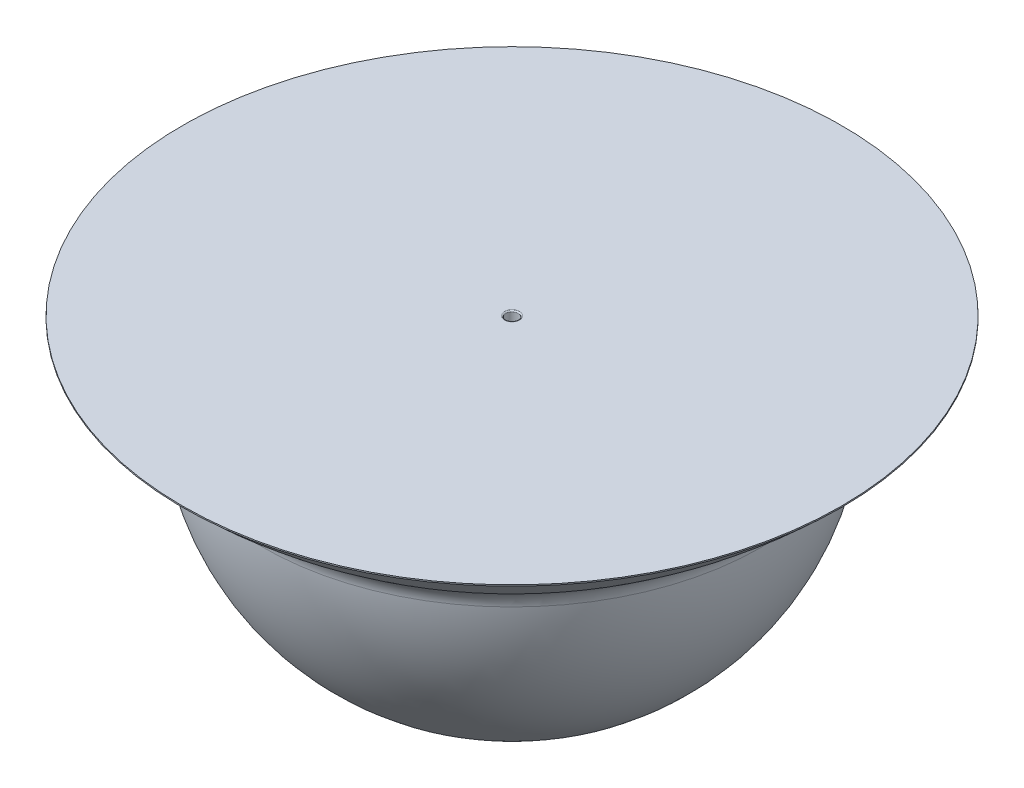
ISO-10303-21;
HEADER;
FILE_DESCRIPTION(('STEP AP214'),'2;1');
FILE_NAME('part.step','',(''),(''),'','','');
FILE_SCHEMA(('AUTOMOTIVE_DESIGN { 1 0 10303 214 1 1 1 1 }'));
ENDSEC;
DATA;
#1=APPLICATION_CONTEXT('core data for automotive mechanical design processes');
#2=APPLICATION_PROTOCOL_DEFINITION('international standard','automotive_design',2000,#1);
#3=PRODUCT_CONTEXT('',#1,'mechanical');
#4=PRODUCT('Part','Part','',(#3));
#5=PRODUCT_RELATED_PRODUCT_CATEGORY('part','',(#4));
#6=PRODUCT_DEFINITION_FORMATION('','',#4);
#7=PRODUCT_DEFINITION_CONTEXT('part definition',#1,'design');
#8=PRODUCT_DEFINITION('design','',#6,#7);
#9=PRODUCT_DEFINITION_SHAPE('','',#8);
#10=(LENGTH_UNIT() NAMED_UNIT(*) SI_UNIT(.MILLI.,.METRE.));
#11=(NAMED_UNIT(*) PLANE_ANGLE_UNIT() SI_UNIT($,.RADIAN.));
#12=(NAMED_UNIT(*) SI_UNIT($,.STERADIAN.) SOLID_ANGLE_UNIT());
#13=UNCERTAINTY_MEASURE_WITH_UNIT(LENGTH_MEASURE(1.E-05),#10,'distance_accuracy_value','');
#14=(GEOMETRIC_REPRESENTATION_CONTEXT(3) GLOBAL_UNCERTAINTY_ASSIGNED_CONTEXT((#13)) GLOBAL_UNIT_ASSIGNED_CONTEXT((#10,
#11,#12)) REPRESENTATION_CONTEXT('',''));
#15=CARTESIAN_POINT('',(0.,0.,0.));
#16=DIRECTION('',(0.,0.,1.));
#17=DIRECTION('',(1.,0.,0.));
#18=AXIS2_PLACEMENT_3D('',#15,#16,#17);
#19=CARTESIAN_POINT('',(0.,0.,0.));
#20=DIRECTION('',(0.,1.,0.));
#21=DIRECTION('',(1.,0.,0.));
#22=AXIS2_PLACEMENT_3D('',#19,#20,#21);
#23=SPHERICAL_SURFACE('',#22,200.);
#24=CARTESIAN_POINT('',(0.,-199.909979740882,0.));
#25=DIRECTION('',(0.,1.,0.));
#26=DIRECTION('',(0.,0.,1.));
#27=AXIS2_PLACEMENT_3D('',#24,#25,#26);
#28=CIRCLE('',#27,6.);
#29=CARTESIAN_POINT('',(5.9999999999993,-199.909979740882,0.));
#30=VERTEX_POINT('',#29);
#31=EDGE_CURVE('E57',#30,#30,#28,.T.);
#32=CARTESIAN_POINT('',(0.,-10.1470704083903,0.));
#33=DIRECTION('',(0.,1.,0.));
#34=DIRECTION('',(0.,0.,1.));
#35=AXIS2_PLACEMENT_3D('',#32,#33,#34);
#36=CIRCLE('',#35,199.742426545106);
#37=CARTESIAN_POINT('',(199.742426545106,-10.1470704083903,0.));
#38=VERTEX_POINT('',#37);
#39=EDGE_CURVE('E51',#38,#38,#36,.F.);
#40=CARTESIAN_POINT('',(5.9999999999993,-199.909979740882,0.));
#41=CARTESIAN_POINT('',(7.55142103377835,-199.863419669229,0.));
#42=CARTESIAN_POINT('',(9.10229967678667,-199.798792770031,0.));
#43=CARTESIAN_POINT('',(12.2021324008323,-199.633455770132,0.));
#44=CARTESIAN_POINT('',(13.7510864818696,-199.532745669431,0.));
#45=CARTESIAN_POINT('',(16.8462303015436,-199.295292720118,0.));
#46=CARTESIAN_POINT('',(18.3924200401803,-199.158549871504,0.));
#47=CARTESIAN_POINT('',(21.4811971724553,-198.849106650805,0.));
#48=CARTESIAN_POINT('',(23.0237845660936,-198.676406278718,0.));
#49=CARTESIAN_POINT('',(26.1045208834127,-198.295141320931,0.));
#50=CARTESIAN_POINT('',(27.6426698070936,-198.08657673523,0.));
#51=CARTESIAN_POINT('',(30.7136954853348,-197.63369647535,0.));
#52=CARTESIAN_POINT('',(32.2465722398951,-197.389380801171,0.));
#53=CARTESIAN_POINT('',(35.3062227329617,-196.865130766363,0.));
#54=CARTESIAN_POINT('',(36.8329964714681,-196.585196405735,0.));
#55=CARTESIAN_POINT('',(39.8796133948749,-195.989860733017,0.));
#56=CARTESIAN_POINT('',(41.3994565797754,-195.674459420928,0.));
#57=CARTESIAN_POINT('',(44.431388614513,-195.008360796744,0.));
#58=CARTESIAN_POINT('',(45.94347746435,-194.657663484649,0.));
#59=CARTESIAN_POINT('',(48.9590812505905,-193.92116294489,0.));
#60=CARTESIAN_POINT('',(50.462596186994,-193.535359717226,0.));
#61=CARTESIAN_POINT('',(53.4602372151794,-192.728856458262,0.));
#62=CARTESIAN_POINT('',(54.9543633069614,-192.308156426963,0.));
#63=CARTESIAN_POINT('',(57.9324168036399,-191.432087587475,0.));
#64=CARTESIAN_POINT('',(59.4163442085366,-190.976718779287,0.));
#65=CARTESIAN_POINT('',(62.3731960170439,-190.031559203806,0.));
#66=CARTESIAN_POINT('',(63.8461204206545,-189.541768436515,0.));
#67=CARTESIAN_POINT('',(66.7801678760075,-188.528030417926,0.));
#68=CARTESIAN_POINT('',(68.2412909277498,-188.004083166628,0.));
#69=CARTESIAN_POINT('',(71.150943725321,-186.922316168526,0.));
#70=CARTESIAN_POINT('',(72.5994734711498,-186.364496421722,0.));
#71=CARTESIAN_POINT('',(75.4831545286391,-185.215286780589,0.));
#72=CARTESIAN_POINT('',(76.9183058402997,-184.62389688626,0.));
#73=CARTESIAN_POINT('',(79.7744521525411,-183.40786749366,0.));
#74=CARTESIAN_POINT('',(81.1954471531221,-182.78322799539,0.));
#75=CARTESIAN_POINT('',(84.0225106392592,-181.501037960354,0.));
#76=CARTESIAN_POINT('',(85.4285791248153,-180.843487423588,0.));
#77=CARTESIAN_POINT('',(88.2250274673879,-179.49583171536,0.));
#78=CARTESIAN_POINT('',(89.6154073244044,-178.805726543898,0.));
#79=CARTESIAN_POINT('',(92.3797247998914,-177.393335615255,0.));
#80=CARTESIAN_POINT('',(93.753662418362,-176.671049858074,0.));
#81=CARTESIAN_POINT('',(96.4843507187297,-175.194689249404,0.));
#82=CARTESIAN_POINT('',(97.8411014006269,-174.440614397916,0.));
#83=CARTESIAN_POINT('',(100.536680445438,-172.901084322285,0.));
#84=CARTESIAN_POINT('',(101.875508808352,-172.115629098143,0.));
#85=CARTESIAN_POINT('',(104.534517546995,-170.513764007564,0.));
#86=CARTESIAN_POINT('',(105.854697922724,-169.697354141127,0.));
#87=CARTESIAN_POINT('',(108.475695126328,-168.034022274271,0.));
#88=CARTESIAN_POINT('',(109.776511954202,-167.187100273852,0.));
#89=CARTESIAN_POINT('',(112.358076996807,-165.463203185451,0.));
#90=CARTESIAN_POINT('',(113.638825211537,-164.586228097469,0.));
#91=CARTESIAN_POINT('',(116.179558840098,-162.802700169654,0.));
#92=CARTESIAN_POINT('',(117.439544253929,-161.896147329822,0.));
#93=CARTESIAN_POINT('',(119.938069346738,-160.053955265677,0.));
#94=CARTESIAN_POINT('',(121.176609025715,-159.118316041363,0.));
#95=CARTESIAN_POINT('',(123.631571338821,-157.218458340947,0.));
#96=CARTESIAN_POINT('',(124.847993972949,-156.254239864845,0.));
#97=CARTESIAN_POINT('',(127.258062874183,-154.297746283997,0.));
#98=CARTESIAN_POINT('',(128.451709141289,-153.30547117925,0.));
#99=CARTESIAN_POINT('',(130.815578331491,-151.293402171436,0.));
#100=CARTESIAN_POINT('',(131.985801254587,-150.273608268367,0.));
#101=CARTESIAN_POINT('',(134.302189475643,-148.207054409899,0.));
#102=CARTESIAN_POINT('',(135.448354773602,-147.160294454498,0.));
#103=CARTESIAN_POINT('',(137.716006502905,-145.040375853423,0.));
#104=CARTESIAN_POINT('',(138.837492934248,-143.967217207747,0.));
#105=CARTESIAN_POINT('',(141.055179065216,-141.795082896728,0.));
#106=CARTESIAN_POINT('',(142.151378764841,-140.696107231384,0.));
#107=CARTESIAN_POINT('',(144.317897273113,-138.472934544904,0.));
#108=CARTESIAN_POINT('',(145.388216081761,-137.348737523769,0.));
#109=CARTESIAN_POINT('',(147.502392676717,-135.075731459999,0.));
#110=CARTESIAN_POINT('',(148.546250463025,-133.926922417363,0.));
#111=CARTESIAN_POINT('',(150.606939224268,-131.605314985026,0.));
#112=CARTESIAN_POINT('',(151.623770199203,-130.432516595324,0.));
#113=CARTESIAN_POINT('',(153.62985419767,-128.063566145929,0.));
#114=CARTESIAN_POINT('',(154.619107221203,-126.867414086236,0.));
#115=CARTESIAN_POINT('',(156.569499124561,-124.452404632029,0.));
#116=CARTESIAN_POINT('',(157.530638004387,-123.233547237515,0.));
#117=CARTESIAN_POINT('',(159.424280666385,-120.773787755521,0.));
#118=CARTESIAN_POINT('',(160.356784448557,-119.532885668042,0.));
#119=CARTESIAN_POINT('',(162.192651482016,-117.029709390579,0.));
#120=CARTESIAN_POINT('',(163.096014733304,-115.767435200595,0.));
#121=CARTESIAN_POINT('',(164.873111066439,-113.222198892636,0.));
#122=CARTESIAN_POINT('',(165.746844148287,-111.939236774661,0.));
#123=CARTESIAN_POINT('',(167.464206564053,-109.353319998445,0.));
#124=CARTESIAN_POINT('',(168.307835897971,-108.050365340206,0.));
#125=CARTESIAN_POINT('',(169.96453355614,-105.425169707493,0.));
#126=CARTESIAN_POINT('',(170.777601880392,-104.102928733021,0.));
#127=CARTESIAN_POINT('',(172.372736822091,-101.439877145393,0.));
#128=CARTESIAN_POINT('',(173.154803439538,-100.099066532237,0.));
#129=CARTESIAN_POINT('',(174.687511073951,-97.3996024098588,0.));
#130=CARTESIAN_POINT('',(175.438152090917,-96.040948900636,0.));
#131=CARTESIAN_POINT('',(176.907601663913,-93.3065353998982,0.));
#132=CARTESIAN_POINT('',(177.626410219943,-91.9307754083833,0.));
#133=CARTESIAN_POINT('',(179.031805264359,-89.1628946288467,0.));
#134=CARTESIAN_POINT('',(179.718391752744,-87.7707738408251,0.));
#135=CARTESIAN_POINT('',(181.058970520081,-84.970926021896,0.));
#136=CARTESIAN_POINT('',(181.712962799033,-83.5631989909886,0.));
#137=CARTESIAN_POINT('',(182.987998672339,-80.7329016987634,0.));
#138=CARTESIAN_POINT('',(183.609042266694,-79.3103314374455,0.));
#139=CARTESIAN_POINT('',(184.817844154405,-76.4511187421632,0.));
#140=CARTESIAN_POINT('',(185.40560244776,-75.0144763081987,0.));
#141=CARTESIAN_POINT('',(186.547515158278,-72.1278979527486,0.));
#142=CARTESIAN_POINT('',(187.101669575441,-70.6779620312629,0.));
#143=CARTESIAN_POINT('',(188.176074172265,-67.7655825911969,0.));
#144=CARTESIAN_POINT('',(188.696324351927,-66.3031390726165,0.));
#145=CARTESIAN_POINT('',(189.702638489123,-63.3665371081219,0.));
#146=CARTESIAN_POINT('',(190.188702446658,-61.8923786622077,0.));
#147=CARTESIAN_POINT('',(191.12638068451,-58.9331458625009,0.));
#148=CARTESIAN_POINT('',(191.577994964827,-57.4480715087083,0.));
#149=CARTESIAN_POINT('',(192.446529065438,-54.4678118293089,0.));
#150=CARTESIAN_POINT('',(192.863448885733,-52.9726265037021,0.));
#151=CARTESIAN_POINT('',(193.662368088632,-49.972955297071,0.));
#152=CARTESIAN_POINT('',(194.044367471238,-48.4684694160467,0.));
#153=CARTESIAN_POINT('',(194.773238748057,-45.4510125560011,0.));
#154=CARTESIAN_POINT('',(195.12011064227,-43.9380415769798,0.));
#155=CARTESIAN_POINT('',(195.778538933248,-40.9044345775749,0.));
#156=CARTESIAN_POINT('',(196.090095330013,-39.3837985571911,0.));
#157=CARTESIAN_POINT('',(196.677723751418,-36.3356856857451,0.));
#158=CARTESIAN_POINT('',(196.95379577606,-34.8082088346828,0.));
#159=CARTESIAN_POINT('',(197.47030583867,-31.7472422224133,0.));
#160=CARTESIAN_POINT('',(197.710743876638,-30.2137524612062,0.));
#161=CARTESIAN_POINT('',(198.155855564906,-27.1415912008143,0.));
#162=CARTESIAN_POINT('',(198.360529215207,-25.6029197016297,0.));
#163=CARTESIAN_POINT('',(198.734001487817,-22.5212289739132,0.));
#164=CARTESIAN_POINT('',(198.902800110126,-20.9782097453814,0.));
#165=CARTESIAN_POINT('',(199.204429728993,-17.8886598201292,0.));
#166=CARTESIAN_POINT('',(199.337260725551,-16.3421291234088,0.));
#167=CARTESIAN_POINT('',(199.566887223779,-13.2463948144101,0.));
#168=CARTESIAN_POINT('',(199.663682725449,-11.6971912021319,0.));
#169=CARTESIAN_POINT('',(199.742426545106,-10.1470704083903,0.));
#170=B_SPLINE_CURVE_WITH_KNOTS('',3,(#40,#41,#42,#43,#44,#45,#46,#47,#48,#49,#50,#51,#52,#53,
#54,#55,#56,#57,#58,#59,#60,#61,#62,#63,#64,#65,#66,#67,#68,#69,#70,#71,#72,#73,#74,#75,#76,#77,
#78,#79,#80,#81,#82,#83,#84,#85,#86,#87,#88,#89,#90,#91,#92,#93,#94,#95,#96,#97,#98,#99,#100,
#101,#102,#103,#104,#105,#106,#107,#108,#109,#110,#111,#112,#113,#114,#115,#116,#117,#118,#119,
#120,#121,#122,#123,#124,#125,#126,#127,#128,#129,#130,#131,#132,#133,#134,#135,#136,#137,#138,
#139,#140,#141,#142,#143,#144,#145,#146,#147,#148,#149,#150,#151,#152,#153,#154,#155,#156,#157,
#158,#159,#160,#161,#162,#163,#164,#165,#166,#167,#168,#169),.UNSPECIFIED.,.F.,.F.,(4,2,2,2,2,2,
2,2,2,2,2,2,2,2,2,2,2,2,2,2,2,2,2,2,2,2,2,2,2,2,2,2,2,2,2,2,2,2,2,2,2,2,2,2,2,2,2,2,2,2,2,2,2,2,
2,2,2,2,2,2,2,2,2,2,4),(0.,4.65625321640933,9.31250643281866,13.968759649228,18.6250128656373,
23.2812660820466,27.937519298456,32.5937725148653,37.2500257312746,41.906278947684,
46.5625321640933,51.2187853805026,55.8750385969119,60.5312918133213,65.1875450297306,
69.8437982461399,74.5000514625493,79.1563046789586,83.8125578953679,88.4688111117773,
93.1250643281866,97.7813175445959,102.437570761005,107.093823977415,111.750077193824,
116.406330410233,121.062583626643,125.718836843052,130.375090059461,135.031343275871,
139.68759649228,144.343849708689,149.000102925099,153.656356141508,158.312609357917,
162.968862574327,167.625115790736,172.281369007145,176.937622223555,181.593875439964,
186.250128656373,190.906381872783,195.562635089192,200.218888305601,204.875141522011,
209.53139473842,214.187647954829,218.843901171239,223.500154387648,228.156407604057,
232.812660820467,237.468914036876,242.125167253285,246.781420469695,251.437673686104,
256.093926902513,260.750180118923,265.406433335332,270.062686551741,274.718939768151,
279.37519298456,284.031446200969,288.687699417379,293.343952633788,298.000205850197),.UNSPECIFIED.);
#171=EDGE_CURVE('BSEAM35',#30,#38,#170,.T.);
#172=ORIENTED_EDGE('',*,*,#31,.T.);
#173=ORIENTED_EDGE('',*,*,#39,.T.);
#174=ORIENTED_EDGE('',*,*,#171,.T.);
#175=ORIENTED_EDGE('',*,*,#171,.F.);
#176=EDGE_LOOP('',(#172,#174,#173,#175));
#177=FACE_BOUND('',#176,.T.);
#178=ADVANCED_FACE('F35',(#177),#23,.T.);
#179=CARTESIAN_POINT('',(0.,324.21730487242,0.));
#180=DIRECTION('',(0.,1.,0.));
#181=DIRECTION('',(1.,0.,0.));
#182=AXIS2_PLACEMENT_3D('',#179,#180,#181);
#183=SPHERICAL_SURFACE('',#182,380.942070108745);
#184=CARTESIAN_POINT('',(0.,5.56777563711491,0.));
#185=DIRECTION('',(0.,1.,0.));
#186=DIRECTION('',(0.,0.,1.));
#187=AXIS2_PLACEMENT_3D('',#184,#185,#186);
#188=CIRCLE('',#187,208.756648509345);
#189=CARTESIAN_POINT('',(208.756648509345,5.56777563711486,0.));
#190=VERTEX_POINT('',#189);
#191=EDGE_CURVE('E61',#190,#190,#188,.T.);
#192=CARTESIAN_POINT('',(0.,50.0000000000002,0.));
#193=DIRECTION('',(0.,1.,0.));
#194=DIRECTION('',(0.,0.,1.));
#195=AXIS2_PLACEMENT_3D('',#192,#193,#194);
#196=CIRCLE('',#195,264.427174260215);
#197=CARTESIAN_POINT('',(264.427174260215,50.0000000000001,0.));
#198=VERTEX_POINT('',#197);
#199=EDGE_CURVE('E64',#198,#198,#196,.T.);
#200=CARTESIAN_POINT('',(208.756648509345,5.56777563711486,0.));
#201=CARTESIAN_POINT('',(209.378187867357,5.97496426037436,0.));
#202=CARTESIAN_POINT('',(209.998535838434,6.38397143545139,0.));
#203=CARTESIAN_POINT('',(211.236827830035,7.20560878640736,0.));
#204=CARTESIAN_POINT('',(211.854771850559,7.6182389622863,0.));
#205=CARTESIAN_POINT('',(213.088234764367,8.44710821201301,0.));
#206=CARTESIAN_POINT('',(213.703753657652,8.86334728586077,0.));
#207=CARTESIAN_POINT('',(214.932345245393,9.69942007187733,0.));
#208=CARTESIAN_POINT('',(215.545417939849,10.1192537840461,0.));
#209=CARTESIAN_POINT('',(216.769096136196,10.9625014728782,0.));
#210=CARTESIAN_POINT('',(217.379701638086,11.3859154495415,0.));
#211=CARTESIAN_POINT('',(218.598424541627,12.2363091685562,0.));
#212=CARTESIAN_POINT('',(219.206541943278,12.6632889109074,0.));
#213=CARTESIAN_POINT('',(220.420267823437,13.5207995410341,0.));
#214=CARTESIAN_POINT('',(221.025876301945,13.9513304288095,0.));
#215=CARTESIAN_POINT('',(222.234563598941,14.8159286077526,0.));
#216=CARTESIAN_POINT('',(222.837642417428,15.2499958989203,0.));
#217=CARTESIAN_POINT('',(224.04124974409,16.1216520215711,0.));
#218=CARTESIAN_POINT('',(224.641778252265,16.5592408530541,0.));
#219=CARTESIAN_POINT('',(225.840264395347,17.4379250726631,0.));
#220=CARTESIAN_POINT('',(226.438222030254,17.8790204607891,0.));
#221=CARTESIAN_POINT('',(227.631545951872,18.7647026899459,0.));
#222=CARTESIAN_POINT('',(228.226912238583,19.2092895309766,0.));
#223=CARTESIAN_POINT('',(229.415033077613,20.1019394426512,0.));
#224=CARTESIAN_POINT('',(230.007787629932,20.550002513295,0.));
#225=CARTESIAN_POINT('',(231.190664703411,21.4495895418733,0.));
#226=CARTESIAN_POINT('',(231.780787224572,21.9011134998078,0.));
#227=CARTESIAN_POINT('',(232.958380029092,22.8076068421392,0.));
#228=CARTESIAN_POINT('',(233.545850312452,23.262576226536,0.));
#229=CARTESIAN_POINT('',(234.718118525546,24.1759448429875,0.));
#230=CARTESIAN_POINT('',(235.30291645528,24.6343440750421,0.));
#231=CARTESIAN_POINT('',(236.469819936803,25.5545566905616,0.));
#232=CARTESIAN_POINT('',(237.05192548859,26.0163700740265,0.));
#233=CARTESIAN_POINT('',(238.213424282091,26.9433951792136,0.));
#234=CARTESIAN_POINT('',(238.792817523803,27.4086069009358,0.));
#235=CARTESIAN_POINT('',(239.948871857896,28.3424127531206,0.));
#236=CARTESIAN_POINT('',(240.525532950276,28.8110068835832,0.));
#237=CARTESIAN_POINT('',(241.676103240003,29.7515615079133,0.));
#238=CARTESIAN_POINT('',(242.250012437348,30.2235220017808,0.));
#239=CARTESIAN_POINT('',(243.39505928553,31.1707931923162,0.));
#240=CARTESIAN_POINT('',(243.966196936366,31.6461038889841,0.));
#241=CARTESIAN_POINT('',(245.105681134957,32.6000592097999,0.));
#242=CARTESIAN_POINT('',(245.674027682711,33.0787038339478,0.));
#243=CARTESIAN_POINT('',(246.807910214135,34.0393106202449,0.));
#244=CARTESIAN_POINT('',(247.373446197806,34.521272782394,0.));
#245=CARTESIAN_POINT('',(248.501688236299,35.4884981416176,0.));
#246=CARTESIAN_POINT('',(249.064394291122,35.9737613386921,0.));
#247=CARTESIAN_POINT('',(250.186957204059,36.9475721516575,0.));
#248=CARTESIAN_POINT('',(250.746814062173,37.4361197675485,0.));
#249=CARTESIAN_POINT('',(251.863659411386,38.4164826895777,0.));
#250=CARTESIAN_POINT('',(252.420647902486,38.9082979957161,0.));
#251=CARTESIAN_POINT('',(253.531737445594,39.8951794577697,0.));
#252=CARTESIAN_POINT('',(254.085838497603,40.3902456136851,0.));
#253=CARTESIAN_POINT('',(255.191134189284,41.3836118235488,0.));
#254=CARTESIAN_POINT('',(255.742328828957,41.8819118774971,0.));
#255=CARTESIAN_POINT('',(256.841792822382,42.8817288208003,0.));
#256=CARTESIAN_POINT('',(257.390062176135,43.3832457101552,0.));
#257=CARTESIAN_POINT('',(258.483656823774,44.3894791520519,0.));
#258=CARTESIAN_POINT('',(259.028982117659,44.8941957045936,0.));
#259=CARTESIAN_POINT('',(260.116669974402,45.9068111890097,0.));
#260=CARTESIAN_POINT('',(260.659032537259,46.414710120884,0.));
#261=CARTESIAN_POINT('',(261.740776354856,47.4336729788795,0.));
#262=CARTESIAN_POINT('',(262.280157609595,47.9447369050008,0.));
#263=CARTESIAN_POINT('',(263.355920363475,48.9700122291527,0.));
#264=CARTESIAN_POINT('',(263.892301862615,49.4842236271834,0.));
#265=CARTESIAN_POINT('',(264.427174260215,50.0000000000001,0.));
#266=B_SPLINE_CURVE_WITH_KNOTS('',3,(#200,#201,#202,#203,#204,#205,#206,#207,#208,#209,#210,
#211,#212,#213,#214,#215,#216,#217,#218,#219,#220,#221,#222,#223,#224,#225,#226,#227,#228,#229,
#230,#231,#232,#233,#234,#235,#236,#237,#238,#239,#240,#241,#242,#243,#244,#245,#246,#247,#248,
#249,#250,#251,#252,#253,#254,#255,#256,#257,#258,#259,#260,#261,#262,#263,#264,#265),
.UNSPECIFIED.,.F.,.F.,(4,2,2,2,2,2,2,2,2,2,2,2,2,2,2,2,2,2,2,2,2,2,2,2,2,2,2,2,2,2,2,2,4),(0.,
2.22912753230983,4.45825506461964,6.68738259692947,8.91651012923926,11.1456376615491,
13.3747651938589,15.6038927261688,17.8330202584786,20.0621477907885,22.2912753230982,
24.5204028554081,26.7495303877179,28.9786579200277,31.2077854523376,33.4369129846474,
35.6660405169572,37.8951680492671,40.1242955815769,42.3534231138867,44.5825506461965,
46.8116781785064,49.0408057108162,51.2699332431261,53.4990607754358,55.7281883077456,
57.9573158400555,60.1864433723653,62.4155709046752,64.644698436985,66.8738259692948,
69.1029535016046,71.3320810339144),.UNSPECIFIED.);
#267=EDGE_CURVE('BSEAM105',#190,#198,#266,.T.);
#268=ORIENTED_EDGE('',*,*,#191,.T.);
#269=ORIENTED_EDGE('',*,*,#199,.F.);
#270=ORIENTED_EDGE('',*,*,#267,.T.);
#271=ORIENTED_EDGE('',*,*,#267,.F.);
#272=EDGE_LOOP('',(#268,#270,#269,#271));
#273=FACE_BOUND('',#272,.T.);
#274=ADVANCED_FACE('F105',(#273),#183,.T.);
#275=CARTESIAN_POINT('',(0.,-11.1617774492293,0.));
#276=DIRECTION('',(0.,-1.,0.));
#277=DIRECTION('',(0.,0.,-1.));
#278=AXIS2_PLACEMENT_3D('',#275,#276,#277);
#279=TOROIDAL_SURFACE('',#278,219.716669199617,20.);
#280=ORIENTED_EDGE('',*,*,#39,.F.);
#281=EDGE_LOOP('',(#280));
#282=FACE_BOUND('',#281,.T.);
#283=ORIENTED_EDGE('',*,*,#191,.F.);
#284=EDGE_LOOP('',(#283));
#285=FACE_BOUND('',#284,.T.);
#286=ADVANCED_FACE('F111',(#282,#285),#279,.F.);
#287=CARTESIAN_POINT('',(0.,51.,0.));
#288=DIRECTION('',(0.,-1.,0.));
#289=DIRECTION('',(0.,0.,-1.));
#290=AXIS2_PLACEMENT_3D('',#287,#288,#289);
#291=CYLINDRICAL_SURFACE('',#290,264.427174260215);
#292=CARTESIAN_POINT('',(0.,51.,0.));
#293=DIRECTION('',(0.,1.,0.));
#294=DIRECTION('',(0.,0.,1.));
#295=AXIS2_PLACEMENT_3D('',#292,#293,#294);
#296=CIRCLE('',#295,264.427174260215);
#297=CARTESIAN_POINT('',(0.,51.,264.427174260215));
#298=VERTEX_POINT('',#297);
#299=EDGE_CURVE('E72',#298,#298,#296,.T.);
#300=ORIENTED_EDGE('',*,*,#299,.F.);
#301=EDGE_LOOP('',(#300));
#302=FACE_BOUND('',#301,.T.);
#303=ORIENTED_EDGE('',*,*,#199,.T.);
#304=EDGE_LOOP('',(#303));
#305=FACE_BOUND('',#304,.T.);
#306=ADVANCED_FACE('F102',(#302,#305),#291,.T.);
#307=CARTESIAN_POINT('',(0.,51.,0.));
#308=DIRECTION('',(0.,1.,0.));
#309=DIRECTION('',(0.,0.,1.));
#310=AXIS2_PLACEMENT_3D('',#307,#308,#309);
#311=PLANE('',#310);
#312=CARTESIAN_POINT('',(0.,51.,0.));
#313=DIRECTION('',(0.,1.,0.));
#314=DIRECTION('',(0.,0.,1.));
#315=AXIS2_PLACEMENT_3D('',#312,#313,#314);
#316=CIRCLE('',#315,6.);
#317=CARTESIAN_POINT('',(0.,51.,6.));
#318=VERTEX_POINT('',#317);
#319=EDGE_CURVE('E10',#318,#318,#316,.F.);
#320=ORIENTED_EDGE('',*,*,#319,.T.);
#321=EDGE_LOOP('',(#320));
#322=FACE_BOUND('',#321,.T.);
#323=ORIENTED_EDGE('',*,*,#299,.T.);
#324=EDGE_LOOP('',(#323));
#325=FACE_BOUND('',#324,.T.);
#326=ADVANCED_FACE('F93',(#322,#325),#311,.T.);
#327=CARTESIAN_POINT('',(0.,-200.,0.));
#328=DIRECTION('',(0.,1.,0.));
#329=DIRECTION('',(0.,0.,1.));
#330=AXIS2_PLACEMENT_3D('',#327,#328,#329);
#331=CYLINDRICAL_SURFACE('',#330,5.);
#332=CARTESIAN_POINT('',(0.,50.,0.));
#333=DIRECTION('',(0.,1.,0.));
#334=DIRECTION('',(0.,0.,1.));
#335=AXIS2_PLACEMENT_3D('',#332,#333,#334);
#336=CIRCLE('',#335,5.);
#337=CARTESIAN_POINT('',(0.,50.,5.));
#338=VERTEX_POINT('',#337);
#339=EDGE_CURVE('E43',#338,#338,#336,.T.);
#340=ORIENTED_EDGE('',*,*,#339,.T.);
#341=EDGE_LOOP('',(#340));
#342=FACE_BOUND('',#341,.T.);
#343=CARTESIAN_POINT('',(0.,-219.,0.));
#344=DIRECTION('',(0.,1.,0.));
#345=DIRECTION('',(0.,0.,1.));
#346=AXIS2_PLACEMENT_3D('',#343,#344,#345);
#347=CIRCLE('',#346,5.);
#348=CARTESIAN_POINT('',(0.,-219.,5.));
#349=VERTEX_POINT('',#348);
#350=EDGE_CURVE('E83',#349,#349,#347,.T.);
#351=ORIENTED_EDGE('',*,*,#350,.F.);
#352=EDGE_LOOP('',(#351));
#353=FACE_BOUND('',#352,.T.);
#354=ADVANCED_FACE('F90',(#342,#353),#331,.F.);
#355=CARTESIAN_POINT('',(0.,-219.,0.));
#356=DIRECTION('',(0.,1.,0.));
#357=DIRECTION('',(0.,0.,1.));
#358=AXIS2_PLACEMENT_3D('',#355,#356,#357);
#359=CYLINDRICAL_SURFACE('',#358,6.);
#360=CARTESIAN_POINT('',(0.,-219.,0.));
#361=DIRECTION('',(0.,1.,0.));
#362=DIRECTION('',(0.,0.,1.));
#363=AXIS2_PLACEMENT_3D('',#360,#361,#362);
#364=CIRCLE('',#363,6.);
#365=CARTESIAN_POINT('',(0.,-219.,6.));
#366=VERTEX_POINT('',#365);
#367=EDGE_CURVE('E58',#366,#366,#364,.T.);
#368=ORIENTED_EDGE('',*,*,#367,.T.);
#369=EDGE_LOOP('',(#368));
#370=FACE_BOUND('',#369,.T.);
#371=ORIENTED_EDGE('',*,*,#31,.F.);
#372=EDGE_LOOP('',(#371));
#373=FACE_BOUND('',#372,.T.);
#374=ADVANCED_FACE('F92',(#370,#373),#359,.T.);
#375=CARTESIAN_POINT('',(0.,-219.,0.));
#376=DIRECTION('',(0.,1.,0.));
#377=DIRECTION('',(0.,0.,1.));
#378=AXIS2_PLACEMENT_3D('',#375,#376,#377);
#379=PLANE('',#378);
#380=ORIENTED_EDGE('',*,*,#350,.T.);
#381=EDGE_LOOP('',(#380));
#382=FACE_BOUND('',#381,.T.);
#383=ORIENTED_EDGE('',*,*,#367,.F.);
#384=EDGE_LOOP('',(#383));
#385=FACE_BOUND('',#384,.T.);
#386=ADVANCED_FACE('F87',(#382,#385),#379,.F.);
#387=CARTESIAN_POINT('',(0.,50.,0.));
#388=DIRECTION('',(0.,1.,0.));
#389=DIRECTION('',(0.,0.,1.));
#390=AXIS2_PLACEMENT_3D('',#387,#388,#389);
#391=TOROIDAL_SURFACE('',#390,6.,1.);
#392=ORIENTED_EDGE('',*,*,#319,.F.);
#393=EDGE_LOOP('',(#392));
#394=FACE_BOUND('',#393,.T.);
#395=ORIENTED_EDGE('',*,*,#339,.F.);
#396=EDGE_LOOP('',(#395));
#397=FACE_BOUND('',#396,.T.);
#398=ADVANCED_FACE('F37',(#394,#397),#391,.T.);
#399=CLOSED_SHELL('',(#178,#274,#286,#306,#326,#354,#374,#386,#398));
#400=CARTESIAN_POINT('',(0.,324.21730487242,0.));
#401=DIRECTION('',(0.,1.,0.));
#402=DIRECTION('',(1.,0.,0.));
#403=AXIS2_PLACEMENT_3D('',#400,#401,#402);
#404=SPHERICAL_SURFACE('',#403,379.942070108745);
#405=CARTESIAN_POINT('',(0.,6.40425329143213,0.));
#406=DIRECTION('',(0.,1.,0.));
#407=DIRECTION('',(0.,0.,1.));
#408=AXIS2_PLACEMENT_3D('',#405,#406,#407);
#409=CIRCLE('',#408,208.208647474831);
#410=CARTESIAN_POINT('',(208.208647474831,6.40425329143207,0.));
#411=VERTEX_POINT('',#410);
#412=EDGE_CURVE('E71',#411,#411,#409,.T.);
#413=CARTESIAN_POINT('',(0.,50.0000000000001,0.));
#414=DIRECTION('',(0.,-1.,0.));
#415=DIRECTION('',(0.,0.,-1.));
#416=AXIS2_PLACEMENT_3D('',#413,#414,#415);
#417=CIRCLE('',#416,262.984498301753);
#418=CARTESIAN_POINT('',(262.984498301753,50.0000000000001,0.));
#419=VERTEX_POINT('',#418);
#420=EDGE_CURVE('E68',#419,#419,#417,.F.);
#421=CARTESIAN_POINT('',(208.208647474831,6.40425329143207,0.));
#422=CARTESIAN_POINT('',(208.819506501673,6.80444491852912,0.));
#423=CARTESIAN_POINT('',(209.429211706551,7.20639775769876,0.));
#424=CARTESIAN_POINT('',(210.64629426128,8.01381240360061,0.));
#425=CARTESIAN_POINT('',(211.25367161113,8.41927421033282,0.));
#426=CARTESIAN_POINT('',(212.466078244698,9.23369333477721,0.));
#427=CARTESIAN_POINT('',(213.071107528416,9.64265065248938,0.));
#428=CARTESIAN_POINT('',(214.278797917427,10.4640471948268,0.));
#429=CARTESIAN_POINT('',(214.88145902272,10.8764864194521,0.));
#430=CARTESIAN_POINT('',(216.084393015771,11.7048330641553,0.));
#431=CARTESIAN_POINT('',(216.684665903529,12.1207404842331,0.));
#432=CARTESIAN_POINT('',(217.882803503293,12.9560096908219,0.));
#433=CARTESIAN_POINT('',(218.480668215301,13.3753714773329,0.));
#434=CARTESIAN_POINT('',(219.67396958502,14.2175354735155,0.));
#435=CARTESIAN_POINT('',(220.269406242732,14.6403376831871,0.));
#436=CARTESIAN_POINT('',(221.457831706153,15.4893684678662,0.));
#437=CARTESIAN_POINT('',(222.050820511863,15.9155970428737,0.));
#438=CARTESIAN_POINT('',(223.234330554933,16.7714663865196,0.));
#439=CARTESIAN_POINT('',(223.824851792294,17.201107155158,0.));
#440=CARTESIAN_POINT('',(225.003407064371,18.0637866008969,0.));
#441=CARTESIAN_POINT('',(225.591441099088,18.4968252779973,0.));
#442=CARTESIAN_POINT('',(226.765002414278,19.3662861425168,0.));
#443=CARTESIAN_POINT('',(227.350529694751,19.802708329936,0.));
#444=CARTESIAN_POINT('',(228.519058033202,20.6789217044504,0.));
#445=CARTESIAN_POINT('',(229.10205909118,21.1187128915456,0.));
#446=CARTESIAN_POINT('',(230.265515600383,22.0016496427534,0.));
#447=CARTESIAN_POINT('',(230.845971051609,22.444795206866,0.));
#448=CARTESIAN_POINT('',(232.004317047689,23.3344259779199,0.));
#449=CARTESIAN_POINT('',(232.582207592544,23.7809111848612,0.));
#450=CARTESIAN_POINT('',(233.735404561546,24.6772063963436,0.));
#451=CARTESIAN_POINT('',(234.310710985693,25.1270164008847,0.));
#452=CARTESIAN_POINT('',(235.458720584861,26.0299462517915,0.));
#453=CARTESIAN_POINT('',(236.031423759883,26.4830660981572,0.));
#454=CARTESIAN_POINT('',(237.174207818938,27.3926005668884,0.));
#455=CARTESIAN_POINT('',(237.744288702972,27.8490151892541,0.));
#456=CARTESIAN_POINT('',(238.881809225379,28.7651240346123,0.));
#457=CARTESIAN_POINT('',(239.449248863753,29.224818257605,0.));
#458=CARTESIAN_POINT('',(240.581468027984,30.1474710198008,0.));
#459=CARTESIAN_POINT('',(241.146247553843,30.6104295590039,0.));
#460=CARTESIAN_POINT('',(242.273127714637,31.5395955606684,0.));
#461=CARTESIAN_POINT('',(242.835228349573,32.0058030231298,0.));
#462=CARTESIAN_POINT('',(243.956732039185,32.9414513703348,0.));
#463=CARTESIAN_POINT('',(244.516135093862,33.4108922550785,0.));
#464=CARTESIAN_POINT('',(245.63222502331,34.3529918383638,0.));
#465=CARTESIAN_POINT('',(246.188911898081,34.8256505369054,0.));
#466=CARTESIAN_POINT('',(247.299550958385,35.7741700323131,0.));
#467=CARTESIAN_POINT('',(247.853503143918,36.2500308291791,0.));
#468=CARTESIAN_POINT('',(248.958654407335,37.2049386992943,0.));
#469=CARTESIAN_POINT('',(249.50985348522,37.6839857725436,0.));
#470=CARTESIAN_POINT('',(250.609480206471,38.6452502675461,0.));
#471=CARTESIAN_POINT('',(251.157907849837,39.1274676892994,0.));
#472=CARTESIAN_POINT('',(252.251973467333,40.0950568480093,0.));
#473=CARTESIAN_POINT('',(252.797611441465,40.580428584966,0.));
#474=CARTESIAN_POINT('',(253.886079578496,41.5543102359418,0.));
#475=CARTESIAN_POINT('',(254.428909741396,42.0428201499609,0.));
#476=CARTESIAN_POINT('',(255.511744207459,43.0229619124385,0.));
#477=CARTESIAN_POINT('',(256.051748510621,43.514593760897,0.));
#478=CARTESIAN_POINT('',(257.128913302163,44.5009630463528,0.));
#479=CARTESIAN_POINT('',(257.666073790543,44.9957004833501,0.));
#480=CARTESIAN_POINT('',(258.73753309388,45.9882644947699,0.));
#481=CARTESIAN_POINT('',(259.271831908838,46.4860910691926,0.));
#482=CARTESIAN_POINT('',(260.337550094926,47.4848168089338,0.));
#483=CARTESIAN_POINT('',(260.868969466056,47.9857159742524,0.));
#484=CARTESIAN_POINT('',(261.928911115632,48.9905702198699,0.));
#485=CARTESIAN_POINT('',(262.457433394078,49.4945253001688,0.));
#486=CARTESIAN_POINT('',(262.984498301753,50.0000000000001,0.));
#487=B_SPLINE_CURVE_WITH_KNOTS('',3,(#421,#422,#423,#424,#425,#426,#427,#428,#429,#430,#431,
#432,#433,#434,#435,#436,#437,#438,#439,#440,#441,#442,#443,#444,#445,#446,#447,#448,#449,#450,
#451,#452,#453,#454,#455,#456,#457,#458,#459,#460,#461,#462,#463,#464,#465,#466,#467,#468,#469,
#470,#471,#472,#473,#474,#475,#476,#477,#478,#479,#480,#481,#482,#483,#484,#485,#486),
.UNSPECIFIED.,.F.,.F.,(4,2,2,2,2,2,2,2,2,2,2,2,2,2,2,2,2,2,2,2,2,2,2,2,2,2,2,2,2,2,2,2,4),(0.,
2.1908230190778,4.3816460381556,6.57246905723339,8.76329207631116,10.954115095389,
13.1449381144667,15.3357611335445,17.5265841526223,19.7174071717001,21.9082301907779,
24.0990532098557,26.2898762289334,28.4806992480112,30.671522267089,32.8623452861668,
35.0531683052446,37.2439913243224,39.4348143434002,41.625637362478,43.8164603815558,
46.0072834006335,48.1981064197113,50.3889294387891,52.5797524578669,54.7705754769447,
56.9613984960225,59.1522215151003,61.3430445341781,63.5338675532559,65.7246905723336,
67.9155135914114,70.1063366104892),.UNSPECIFIED.);
#488=EDGE_CURVE('BSEAM141',#411,#419,#487,.T.);
#489=ORIENTED_EDGE('',*,*,#412,.F.);
#490=ORIENTED_EDGE('',*,*,#420,.T.);
#491=ORIENTED_EDGE('',*,*,#488,.T.);
#492=ORIENTED_EDGE('',*,*,#488,.F.);
#493=EDGE_LOOP('',(#489,#491,#490,#492));
#494=FACE_BOUND('',#493,.T.);
#495=ADVANCED_FACE('F141',(#494),#404,.F.);
#496=CARTESIAN_POINT('',(0.,50.,0.));
#497=DIRECTION('',(0.,1.,0.));
#498=DIRECTION('',(0.,0.,1.));
#499=AXIS2_PLACEMENT_3D('',#496,#497,#498);
#500=PLANE('',#499);
#501=CARTESIAN_POINT('',(0.,50.,0.));
#502=DIRECTION('',(0.,1.,0.));
#503=DIRECTION('',(0.,0.,1.));
#504=AXIS2_PLACEMENT_3D('',#501,#502,#503);
#505=CIRCLE('',#504,6.);
#506=CARTESIAN_POINT('',(0.,50.,6.));
#507=VERTEX_POINT('',#506);
#508=EDGE_CURVE('E54',#507,#507,#505,.T.);
#509=ORIENTED_EDGE('',*,*,#508,.T.);
#510=EDGE_LOOP('',(#509));
#511=FACE_BOUND('',#510,.T.);
#512=ORIENTED_EDGE('',*,*,#420,.F.);
#513=EDGE_LOOP('',(#512));
#514=FACE_BOUND('',#513,.T.);
#515=ADVANCED_FACE('F134',(#511,#514),#500,.F.);
#516=CARTESIAN_POINT('',(0.,-11.1617774492293,0.));
#517=DIRECTION('',(0.,-1.,0.));
#518=DIRECTION('',(0.,0.,-1.));
#519=AXIS2_PLACEMENT_3D('',#516,#517,#518);
#520=TOROIDAL_SURFACE('',#519,219.716669199617,21.);
#521=CARTESIAN_POINT('',(0.,-10.0963350563483,0.));
#522=DIRECTION('',(0.,1.,0.));
#523=DIRECTION('',(0.,0.,1.));
#524=AXIS2_PLACEMENT_3D('',#521,#522,#523);
#525=CIRCLE('',#524,198.743714412381);
#526=CARTESIAN_POINT('',(198.743714412381,-10.0963350563483,0.));
#527=VERTEX_POINT('',#526);
#528=EDGE_CURVE('E67',#527,#527,#525,.F.);
#529=ORIENTED_EDGE('',*,*,#528,.T.);
#530=EDGE_LOOP('',(#529));
#531=FACE_BOUND('',#530,.T.);
#532=ORIENTED_EDGE('',*,*,#412,.T.);
#533=EDGE_LOOP('',(#532));
#534=FACE_BOUND('',#533,.T.);
#535=ADVANCED_FACE('F138',(#531,#534),#520,.T.);
#536=CARTESIAN_POINT('',(0.,0.,0.));
#537=DIRECTION('',(0.,1.,0.));
#538=DIRECTION('',(1.,0.,0.));
#539=AXIS2_PLACEMENT_3D('',#536,#537,#538);
#540=SPHERICAL_SURFACE('',#539,199.);
#541=CARTESIAN_POINT('',(0.,-198.909527172531,0.));
#542=DIRECTION('',(0.,1.,0.));
#543=DIRECTION('',(0.,0.,1.));
#544=AXIS2_PLACEMENT_3D('',#541,#542,#543);
#545=CIRCLE('',#544,6.);
#546=CARTESIAN_POINT('',(6.00000000000024,-198.909527172531,0.));
#547=VERTEX_POINT('',#546);
#548=EDGE_CURVE('E47',#547,#547,#545,.T.);
#549=CARTESIAN_POINT('',(6.00000000000024,-198.909527172531,0.));
#550=CARTESIAN_POINT('',(7.54350067415404,-198.862971795063,0.));
#551=CARTESIAN_POINT('',(9.08645906812762,-198.798443646152,0.));
#552=CARTESIAN_POINT('',(12.1704559753171,-198.633492114974,0.));
#553=CARTESIAN_POINT('',(13.7114944885331,-198.533068732706,0.));
#554=CARTESIAN_POINT('',(16.7908163138101,-198.29637704434,0.));
#555=CARTESIAN_POINT('',(18.3290996258712,-198.160108738242,0.));
#556=CARTESIAN_POINT('',(21.4020775002797,-197.851802148502,0.));
#557=CARTESIAN_POINT('',(22.9367720626271,-197.67976386486,0.));
#558=CARTESIAN_POINT('',(26.0017407591232,-197.300010253759,0.));
#559=CARTESIAN_POINT('',(27.5320148932717,-197.0922949263,0.));
#560=CARTESIAN_POINT('',(30.5873134703637,-196.641299869166,0.));
#561=CARTESIAN_POINT('',(32.112337913307,-196.398020139492,0.));
#562=CARTESIAN_POINT('',(35.156310684467,-195.876028091881,0.));
#563=CARTESIAN_POINT('',(36.6752590126835,-195.597315773945,0.));
#564=CARTESIAN_POINT('',(39.7062564249982,-195.004609591821,0.));
#565=CARTESIAN_POINT('',(41.2183055090962,-194.690615727633,0.));
#566=CARTESIAN_POINT('',(44.2346850421503,-194.027516607158,0.));
#567=CARTESIAN_POINT('',(45.7390154911063,-193.67841135087,0.));
#568=CARTESIAN_POINT('',(48.7391425457431,-192.945278629405,0.));
#569=CARTESIAN_POINT('',(50.2349391514238,-192.561251164228,0.));
#570=CARTESIAN_POINT('',(53.2171879359041,-191.758482132291,0.));
#571=CARTESIAN_POINT('',(54.7036401147037,-191.33974056553,0.));
#572=CARTESIAN_POINT('',(57.6663945256393,-190.467770249708,0.));
#573=CARTESIAN_POINT('',(59.1426967577753,-190.014541500645,0.));
#574=CARTESIAN_POINT('',(62.0843512559332,-189.07384242833,0.));
#575=CARTESIAN_POINT('',(63.549703521955,-188.586372105077,0.));
#576=CARTESIAN_POINT('',(66.4686640023045,-187.577454048272,0.));
#577=CARTESIAN_POINT('',(67.9222722166323,-187.05600631472,0.));
#578=CARTESIAN_POINT('',(70.8169568722047,-185.979416013824,0.));
#579=CARTESIAN_POINT('',(72.2580333134494,-185.424273446481,0.));
#580=CARTESIAN_POINT('',(75.1268734925308,-184.280594313997,0.));
#581=CARTESIAN_POINT('',(76.5546372303673,-183.692057748858,0.));
#582=CARTESIAN_POINT('',(79.3960782865626,-182.48190955324,0.));
#583=CARTESIAN_POINT('',(80.8097556049213,-181.860297922762,0.));
#584=CARTESIAN_POINT('',(83.6222577396295,-180.584336452556,0.));
#585=CARTESIAN_POINT('',(85.021082555979,-179.929986612827,0.));
#586=CARTESIAN_POINT('',(87.8031216528215,-178.588903321294,0.));
#587=CARTESIAN_POINT('',(89.1863359333145,-177.90216986949,0.));
#588=CARTESIAN_POINT('',(91.9364043840656,-176.496691499904,0.));
#589=CARTESIAN_POINT('',(93.3032585543237,-175.777946582123,0.));
#590=CARTESIAN_POINT('',(96.0198660758947,-174.308834773944,0.));
#591=CARTESIAN_POINT('',(97.3696194272077,-173.558467883545,0.));
#592=CARTESIAN_POINT('',(100.051293869243,-172.026518759676,0.));
#593=CARTESIAN_POINT('',(101.383214959966,-171.244936526206,0.));
#594=CARTESIAN_POINT('',(104.028503102612,-169.650980261573,0.));
#595=CARTESIAN_POINT('',(105.341870154536,-168.83860623041,0.));
#596=CARTESIAN_POINT('',(107.949338495955,-167.183506602083,0.));
#597=CARTESIAN_POINT('',(109.243439785449,-166.340781004917,0.));
#598=CARTESIAN_POINT('',(111.811675318638,-164.625434924019,0.));
#599=CARTESIAN_POINT('',(113.085809562333,-163.752814440286,0.));
#600=CARTESIAN_POINT('',(115.613420540851,-161.978151465953,0.));
#601=CARTESIAN_POINT('',(116.866897275673,-161.076108975354,0.));
#602=CARTESIAN_POINT('',(119.352513967833,-159.243090811002,0.));
#603=CARTESIAN_POINT('',(120.584653925171,-158.312115137249,0.));
#604=CARTESIAN_POINT('',(123.026929356312,-156.421735109415,0.));
#605=CARTESIAN_POINT('',(124.237064830115,-155.462330755333,0.));
#606=CARTESIAN_POINT('',(126.634675512535,-153.515613275386,0.));
#607=CARTESIAN_POINT('',(127.822150721152,-152.52830014952,0.));
#608=CARTESIAN_POINT('',(130.173797371318,-150.526300158523,0.));
#609=CARTESIAN_POINT('',(131.337968812868,-149.511613293393,0.));
#610=CARTESIAN_POINT('',(133.642377055507,-147.455415690426,0.));
#611=CARTESIAN_POINT('',(134.782613856597,-146.41390495259,0.));
#612=CARTESIAN_POINT('',(137.03853491529,-144.304624006833,0.));
#613=CARTESIAN_POINT('',(138.154219172893,-143.236853798912,0.));
#614=CARTESIAN_POINT('',(140.360430546796,-141.075632545812,0.));
#615=CARTESIAN_POINT('',(141.450957663095,-139.982181500633,0.));
#616=CARTESIAN_POINT('',(143.60626378942,-137.770191122486,0.));
#617=CARTESIAN_POINT('',(144.671042799446,-136.651651789518,0.));
#618=CARTESIAN_POINT('',(146.77427570135,-134.390090980797,0.));
#619=CARTESIAN_POINT('',(147.812729593227,-133.247069505045,0.));
#620=CARTESIAN_POINT('',(149.862749512743,-130.937163822819,0.));
#621=CARTESIAN_POINT('',(150.87431554038,-129.770279616346,0.));
#622=CARTESIAN_POINT('',(152.870011556063,-127.413280816138,0.));
#623=CARTESIAN_POINT('',(153.854141544107,-126.223166222404,0.));
#624=CARTESIAN_POINT('',(155.794432173049,-123.820351579859,0.));
#625=CARTESIAN_POINT('',(156.750592813947,-122.607651531049,0.));
#626=CARTESIAN_POINT('',(158.634426597844,-120.160323149765,0.));
#627=CARTESIAN_POINT('',(159.562099740844,-118.925694817292,0.));
#628=CARTESIAN_POINT('',(161.388455815787,-116.435178923204,0.));
#629=CARTESIAN_POINT('',(162.287138747731,-115.179291361588,0.));
#630=CARTESIAN_POINT('',(164.05502739742,-112.646937584271,0.));
#631=CARTESIAN_POINT('',(164.924233115165,-111.37047136857,0.));
#632=CARTESIAN_POINT('',(166.632696307243,-108.79765200987,0.));
#633=CARTESIAN_POINT('',(167.471953781576,-107.501298866871,0.));
#634=CARTESIAN_POINT('',(169.120065686798,-104.88940815724,0.));
#635=CARTESIAN_POINT('',(169.928920117686,-103.573870590608,0.));
#636=CARTESIAN_POINT('',(171.515787611626,-100.924323933562,0.));
#637=CARTESIAN_POINT('',(172.293800674678,-99.5903148431472,0.));
#638=CARTESIAN_POINT('',(173.818563821727,-96.9045480482469,0.));
#639=CARTESIAN_POINT('',(174.565313905724,-95.5527903437608,0.));
#640=CARTESIAN_POINT('',(176.027146425093,-92.8322588485367,0.));
#641=CARTESIAN_POINT('',(176.742228860464,-91.4634850577988,0.));
#642=CARTESIAN_POINT('',(178.140338573949,-88.709663139038,0.));
#643=CARTESIAN_POINT('',(178.823365852063,-87.3246150110151,0.));
#644=CARTESIAN_POINT('',(180.156995113337,-84.538994985839,0.));
#645=CARTESIAN_POINT('',(180.807597096498,-83.1384230886858,0.));
#646=CARTESIAN_POINT('',(182.076023201683,-80.3225145058527,0.));
#647=CARTESIAN_POINT('',(182.693847323708,-78.9071778201727,0.));
#648=CARTESIAN_POINT('',(183.896382903015,-76.0625066420414,0.));
#649=CARTESIAN_POINT('',(184.481094360296,-74.63317214959,0.));
#650=CARTESIAN_POINT('',(185.617087750512,-71.7612799251891,0.));
#651=CARTESIAN_POINT('',(186.168369683447,-70.3187221932398,0.));
#652=CARTESIAN_POINT('',(187.237205281083,-67.4211652228911,0.));
#653=CARTESIAN_POINT('',(187.754758945784,-65.9661659844918,0.));
#654=CARTESIAN_POINT('',(188.755857540667,-63.0445144764386,0.));
#655=CARTESIAN_POINT('',(189.23940247085,-61.5778622067846,0.));
#656=CARTESIAN_POINT('',(190.172221560016,-58.6336994262844,0.));
#657=CARTESIAN_POINT('',(190.621495718998,-57.1561889154381,0.));
#658=CARTESIAN_POINT('',(191.485529800639,-54.1911103267771,0.));
#659=CARTESIAN_POINT('',(191.900289723296,-52.7035422489623,0.));
#660=CARTESIAN_POINT('',(192.695070570825,-49.7191546508701,0.));
#661=CARTESIAN_POINT('',(193.075091495698,-48.2223351305928,0.));
#662=CARTESIAN_POINT('',(193.80018841101,-45.2202557854708,0.));
#663=CARTESIAN_POINT('',(194.145264401449,-43.7149959606262,0.));
#664=CARTESIAN_POINT('',(194.800284450102,-40.6968517182731,0.));
#665=CARTESIAN_POINT('',(195.110228508315,-39.1839673007647,0.));
#666=CARTESIAN_POINT('',(195.694816725792,-36.1513937162792,0.));
#667=CARTESIAN_POINT('',(195.969460885056,-34.6317045493022,0.));
#668=CARTESIAN_POINT('',(196.483300494031,-31.5863449986108,0.));
#669=CARTESIAN_POINT('',(196.722495943741,-30.0606746148963,0.));
#670=CARTESIAN_POINT('',(197.165308432792,-27.0041793973007,0.));
#671=CARTESIAN_POINT('',(197.368925472133,-25.4733545634194,0.));
#672=CARTESIAN_POINT('',(197.74047109356,-22.4073800330165,0.));
#673=CARTESIAN_POINT('',(197.908399675647,-20.8722303364947,0.));
#674=CARTESIAN_POINT('',(198.208476280782,-17.7984379085616,0.));
#675=CARTESIAN_POINT('',(198.340624303831,-16.2597951771502,0.));
#676=CARTESIAN_POINT('',(198.569072284138,-13.1798507861771,0.));
#677=CARTESIAN_POINT('',(198.665372241396,-11.6385491266154,0.));
#678=CARTESIAN_POINT('',(198.743714412381,-10.0963350563483,0.));
#679=B_SPLINE_CURVE_WITH_KNOTS('',3,(#549,#550,#551,#552,#553,#554,#555,#556,#557,#558,#559,
#560,#561,#562,#563,#564,#565,#566,#567,#568,#569,#570,#571,#572,#573,#574,#575,#576,#577,#578,
#579,#580,#581,#582,#583,#584,#585,#586,#587,#588,#589,#590,#591,#592,#593,#594,#595,#596,#597,
#598,#599,#600,#601,#602,#603,#604,#605,#606,#607,#608,#609,#610,#611,#612,#613,#614,#615,#616,
#617,#618,#619,#620,#621,#622,#623,#624,#625,#626,#627,#628,#629,#630,#631,#632,#633,#634,#635,
#636,#637,#638,#639,#640,#641,#642,#643,#644,#645,#646,#647,#648,#649,#650,#651,#652,#653,#654,
#655,#656,#657,#658,#659,#660,#661,#662,#663,#664,#665,#666,#667,#668,#669,#670,#671,#672,#673,
#674,#675,#676,#677,#678),.UNSPECIFIED.,.F.,.F.,(4,2,2,2,2,2,2,2,2,2,2,2,2,2,2,2,2,2,2,2,2,2,2,
2,2,2,2,2,2,2,2,2,2,2,2,2,2,2,2,2,2,2,2,2,2,2,2,2,2,2,2,2,2,2,2,2,2,2,2,2,2,2,2,2,4),(0.,
4.63250301995515,9.26500603991029,13.8975090598654,18.5300120798205,23.1625150997757,
27.7950181197308,32.427521139686,37.0600241596411,41.6925271795962,46.3250301995514,
50.9575332195065,55.5900362394617,60.2225392594168,64.855042279372,69.4875452993271,
74.1200483192822,78.7525513392374,83.3850543591925,88.0175573791476,92.6500603991027,
97.2825634190579,101.915066439013,106.547569458968,111.180072478923,115.812575498878,
120.445078518834,125.077581538789,129.710084558744,134.342587578699,138.975090598654,
143.607593618609,148.240096638564,152.87259965852,157.505102678475,162.13760569843,
166.770108718385,171.40261173834,176.035114758295,180.66761777825,185.300120798205,
189.932623818161,194.565126838116,199.197629858071,203.830132878026,208.462635897981,
213.095138917936,217.727641937891,222.360144957847,226.992647977802,231.625150997757,
236.257654017712,240.890157037667,245.522660057622,250.155163077578,254.787666097533,
259.420169117488,264.052672137443,268.685175157398,273.317678177353,277.950181197308,
282.582684217264,287.215187237219,291.847690257174,296.480193277129),.UNSPECIFIED.);
#680=EDGE_CURVE('BSEAM135',#547,#527,#679,.T.);
#681=ORIENTED_EDGE('',*,*,#548,.F.);
#682=ORIENTED_EDGE('',*,*,#528,.F.);
#683=ORIENTED_EDGE('',*,*,#680,.T.);
#684=ORIENTED_EDGE('',*,*,#680,.F.);
#685=EDGE_LOOP('',(#681,#683,#682,#684));
#686=FACE_BOUND('',#685,.T.);
#687=ADVANCED_FACE('F135',(#686),#540,.F.);
#688=ORIENTED_EDGE('',*,*,#548,.T.);
#689=EDGE_LOOP('',(#688));
#690=FACE_BOUND('',#689,.T.);
#691=ORIENTED_EDGE('',*,*,#508,.F.);
#692=EDGE_LOOP('',(#691));
#693=FACE_BOUND('',#692,.T.);
#694=ADVANCED_FACE('F101',(#690,#693),#359,.T.);
#695=CLOSED_SHELL('',(#495,#515,#535,#687,#694));
#696=ORIENTED_CLOSED_SHELL('',*,#695,.T.);
#697=BREP_WITH_VOIDS('B2',#399,(#696));
#698=ADVANCED_BREP_SHAPE_REPRESENTATION('',(#18,#697),#14);
#699=SHAPE_DEFINITION_REPRESENTATION(#9,#698);
ENDSEC;
END-ISO-10303-21;
